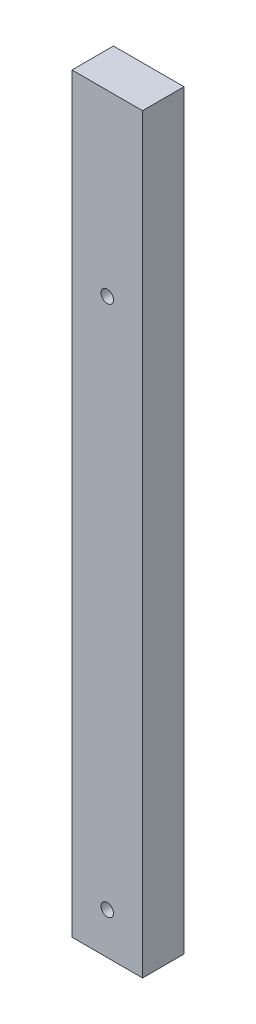
ISO-10303-21;
HEADER;
FILE_DESCRIPTION(('STEP AP214'),'2;1');
FILE_NAME('part.step','',(''),(''),'','','');
FILE_SCHEMA(('AUTOMOTIVE_DESIGN { 1 0 10303 214 1 1 1 1 }'));
ENDSEC;
DATA;
#1=APPLICATION_CONTEXT('core data for automotive mechanical design processes');
#2=APPLICATION_PROTOCOL_DEFINITION('international standard','automotive_design',2000,#1);
#3=PRODUCT_CONTEXT('',#1,'mechanical');
#4=PRODUCT('Part','Part','',(#3));
#5=PRODUCT_RELATED_PRODUCT_CATEGORY('part','',(#4));
#6=PRODUCT_DEFINITION_FORMATION('','',#4);
#7=PRODUCT_DEFINITION_CONTEXT('part definition',#1,'design');
#8=PRODUCT_DEFINITION('design','',#6,#7);
#9=PRODUCT_DEFINITION_SHAPE('','',#8);
#10=(LENGTH_UNIT() NAMED_UNIT(*) SI_UNIT(.MILLI.,.METRE.));
#11=(NAMED_UNIT(*) PLANE_ANGLE_UNIT() SI_UNIT($,.RADIAN.));
#12=(NAMED_UNIT(*) SI_UNIT($,.STERADIAN.) SOLID_ANGLE_UNIT());
#13=UNCERTAINTY_MEASURE_WITH_UNIT(LENGTH_MEASURE(1.E-05),#10,'distance_accuracy_value','');
#14=(GEOMETRIC_REPRESENTATION_CONTEXT(3) GLOBAL_UNCERTAINTY_ASSIGNED_CONTEXT((#13)) GLOBAL_UNIT_ASSIGNED_CONTEXT((#10,
#11,#12)) REPRESENTATION_CONTEXT('',''));
#15=CARTESIAN_POINT('',(0.,0.,0.));
#16=DIRECTION('',(0.,0.,1.));
#17=DIRECTION('',(1.,0.,0.));
#18=AXIS2_PLACEMENT_3D('',#15,#16,#17);
#19=CARTESIAN_POINT('',(-8.50000000000001,90.5,10.));
#20=DIRECTION('',(1.,0.,0.));
#21=DIRECTION('',(0.,1.,0.));
#22=AXIS2_PLACEMENT_3D('',#19,#20,#21);
#23=PLANE('',#22);
#24=DIRECTION('',(0.,-1.,0.));
#25=VECTOR('',#24,1.);
#26=CARTESIAN_POINT('',(-8.50000000000001,90.5,0.));
#27=LINE('',#26,#25);
#28=CARTESIAN_POINT('',(-8.50000000000001,90.5,0.));
#29=VERTEX_POINT('',#28);
#30=CARTESIAN_POINT('',(-8.49999999999999,-90.5,0.));
#31=VERTEX_POINT('',#30);
#32=EDGE_CURVE('E96',#29,#31,#27,.T.);
#33=ORIENTED_EDGE('',*,*,#32,.T.);
#34=DIRECTION('',(0.,0.,-1.));
#35=VECTOR('',#34,1.);
#36=CARTESIAN_POINT('',(-8.49999999999999,-90.5,10.));
#37=LINE('',#36,#35);
#38=CARTESIAN_POINT('',(-8.49999999999999,-90.5,10.));
#39=VERTEX_POINT('',#38);
#40=EDGE_CURVE('E11',#39,#31,#37,.T.);
#41=ORIENTED_EDGE('',*,*,#40,.F.);
#42=DIRECTION('',(0.,-1.,0.));
#43=VECTOR('',#42,1.);
#44=CARTESIAN_POINT('',(-8.50000000000001,90.5,10.));
#45=LINE('',#44,#43);
#46=CARTESIAN_POINT('',(-8.50000000000001,90.5,10.));
#47=VERTEX_POINT('',#46);
#48=EDGE_CURVE('E84',#47,#39,#45,.T.);
#49=ORIENTED_EDGE('',*,*,#48,.F.);
#50=DIRECTION('',(0.,0.,-1.));
#51=VECTOR('',#50,1.);
#52=CARTESIAN_POINT('',(-8.50000000000001,90.5,10.));
#53=LINE('',#52,#51);
#54=EDGE_CURVE('E92',#47,#29,#53,.T.);
#55=ORIENTED_EDGE('',*,*,#54,.T.);
#56=EDGE_LOOP('',(#33,#41,#49,#55));
#57=FACE_BOUND('',#56,.T.);
#58=ADVANCED_FACE('F33',(#57),#23,.F.);
#59=CARTESIAN_POINT('',(-8.49999999999999,-90.5,10.));
#60=DIRECTION('',(0.,1.,0.));
#61=DIRECTION('',(0.,0.,1.));
#62=AXIS2_PLACEMENT_3D('',#59,#60,#61);
#63=PLANE('',#62);
#64=DIRECTION('',(1.,0.,0.));
#65=VECTOR('',#64,1.);
#66=CARTESIAN_POINT('',(-8.49999999999999,-90.5,0.));
#67=LINE('',#66,#65);
#68=CARTESIAN_POINT('',(8.50000000000001,-90.5,0.));
#69=VERTEX_POINT('',#68);
#70=EDGE_CURVE('E88',#31,#69,#67,.T.);
#71=ORIENTED_EDGE('',*,*,#70,.T.);
#72=DIRECTION('',(0.,0.,-1.));
#73=VECTOR('',#72,1.);
#74=CARTESIAN_POINT('',(8.50000000000001,-90.5,10.));
#75=LINE('',#74,#73);
#76=CARTESIAN_POINT('',(8.50000000000001,-90.5,10.));
#77=VERTEX_POINT('',#76);
#78=EDGE_CURVE('E41',#77,#69,#75,.T.);
#79=ORIENTED_EDGE('',*,*,#78,.F.);
#80=DIRECTION('',(1.,0.,0.));
#81=VECTOR('',#80,1.);
#82=CARTESIAN_POINT('',(-8.49999999999999,-90.5,10.));
#83=LINE('',#82,#81);
#84=EDGE_CURVE('E79',#39,#77,#83,.T.);
#85=ORIENTED_EDGE('',*,*,#84,.F.);
#86=ORIENTED_EDGE('',*,*,#40,.T.);
#87=EDGE_LOOP('',(#71,#79,#85,#86));
#88=FACE_BOUND('',#87,.T.);
#89=ADVANCED_FACE('F87',(#88),#63,.F.);
#90=CARTESIAN_POINT('',(8.49999999999999,90.5,10.));
#91=DIRECTION('',(-1.,0.,0.));
#92=DIRECTION('',(0.,-1.,0.));
#93=AXIS2_PLACEMENT_3D('',#90,#91,#92);
#94=PLANE('',#93);
#95=DIRECTION('',(0.,1.,0.));
#96=VECTOR('',#95,1.);
#97=CARTESIAN_POINT('',(8.49999999999999,90.5,0.));
#98=LINE('',#97,#96);
#99=CARTESIAN_POINT('',(8.49999999999999,90.5,0.));
#100=VERTEX_POINT('',#99);
#101=EDGE_CURVE('E66',#69,#100,#98,.T.);
#102=ORIENTED_EDGE('',*,*,#101,.T.);
#103=DIRECTION('',(0.,0.,-1.));
#104=VECTOR('',#103,1.);
#105=CARTESIAN_POINT('',(8.49999999999999,90.5,10.));
#106=LINE('',#105,#104);
#107=CARTESIAN_POINT('',(8.49999999999999,90.5,10.));
#108=VERTEX_POINT('',#107);
#109=EDGE_CURVE('E89',#108,#100,#106,.T.);
#110=ORIENTED_EDGE('',*,*,#109,.F.);
#111=DIRECTION('',(0.,1.,0.));
#112=VECTOR('',#111,1.);
#113=CARTESIAN_POINT('',(8.49999999999999,90.5,10.));
#114=LINE('',#113,#112);
#115=EDGE_CURVE('E82',#77,#108,#114,.T.);
#116=ORIENTED_EDGE('',*,*,#115,.F.);
#117=ORIENTED_EDGE('',*,*,#78,.T.);
#118=EDGE_LOOP('',(#102,#110,#116,#117));
#119=FACE_BOUND('',#118,.T.);
#120=ADVANCED_FACE('F90',(#119),#94,.F.);
#121=CARTESIAN_POINT('',(-8.50000000000001,90.5,10.));
#122=DIRECTION('',(0.,-1.,0.));
#123=DIRECTION('',(0.,0.,-1.));
#124=AXIS2_PLACEMENT_3D('',#121,#122,#123);
#125=PLANE('',#124);
#126=DIRECTION('',(-1.,0.,0.));
#127=VECTOR('',#126,1.);
#128=CARTESIAN_POINT('',(-8.50000000000001,90.5,0.));
#129=LINE('',#128,#127);
#130=EDGE_CURVE('E72',#100,#29,#129,.T.);
#131=ORIENTED_EDGE('',*,*,#130,.T.);
#132=ORIENTED_EDGE('',*,*,#54,.F.);
#133=DIRECTION('',(-1.,0.,0.));
#134=VECTOR('',#133,1.);
#135=CARTESIAN_POINT('',(-8.50000000000001,90.5,10.));
#136=LINE('',#135,#134);
#137=EDGE_CURVE('E49',#108,#47,#136,.T.);
#138=ORIENTED_EDGE('',*,*,#137,.F.);
#139=ORIENTED_EDGE('',*,*,#109,.T.);
#140=EDGE_LOOP('',(#131,#132,#138,#139));
#141=FACE_BOUND('',#140,.T.);
#142=ADVANCED_FACE('F104',(#141),#125,.F.);
#143=CARTESIAN_POINT('',(0.,0.,10.));
#144=DIRECTION('',(0.,0.,1.));
#145=DIRECTION('',(1.,0.,0.));
#146=AXIS2_PLACEMENT_3D('',#143,#144,#145);
#147=PLANE('',#146);
#148=CARTESIAN_POINT('',(0.,-80.5,10.));
#149=DIRECTION('',(0.,0.,1.));
#150=DIRECTION('',(1.,0.,0.));
#151=AXIS2_PLACEMENT_3D('',#148,#149,#150);
#152=CIRCLE('',#151,1.5);
#153=CARTESIAN_POINT('',(1.5,-80.5,10.));
#154=VERTEX_POINT('',#153);
#155=EDGE_CURVE('E116',#154,#154,#152,.T.);
#156=ORIENTED_EDGE('',*,*,#155,.F.);
#157=EDGE_LOOP('',(#156));
#158=FACE_BOUND('',#157,.T.);
#159=CARTESIAN_POINT('',(0.,47.5,10.));
#160=DIRECTION('',(0.,0.,1.));
#161=DIRECTION('',(1.,0.,0.));
#162=AXIS2_PLACEMENT_3D('',#159,#160,#161);
#163=CIRCLE('',#162,1.5);
#164=CARTESIAN_POINT('',(1.5,47.5,10.));
#165=VERTEX_POINT('',#164);
#166=EDGE_CURVE('E110',#165,#165,#163,.T.);
#167=ORIENTED_EDGE('',*,*,#166,.F.);
#168=EDGE_LOOP('',(#167));
#169=FACE_BOUND('',#168,.T.);
#170=ORIENTED_EDGE('',*,*,#48,.T.);
#171=ORIENTED_EDGE('',*,*,#84,.T.);
#172=ORIENTED_EDGE('',*,*,#115,.T.);
#173=ORIENTED_EDGE('',*,*,#137,.T.);
#174=EDGE_LOOP('',(#170,#171,#172,#173));
#175=FACE_BOUND('',#174,.T.);
#176=ADVANCED_FACE('F80',(#158,#169,#175),#147,.T.);
#177=CARTESIAN_POINT('',(0.,0.,0.));
#178=DIRECTION('',(0.,0.,1.));
#179=DIRECTION('',(1.,0.,0.));
#180=AXIS2_PLACEMENT_3D('',#177,#178,#179);
#181=PLANE('',#180);
#182=CARTESIAN_POINT('',(0.,-40.5,0.));
#183=DIRECTION('',(0.,0.,-1.));
#184=DIRECTION('',(-1.,0.,0.));
#185=AXIS2_PLACEMENT_3D('',#182,#183,#184);
#186=CIRCLE('',#185,1.5);
#187=CARTESIAN_POINT('',(-1.5,-40.5,0.));
#188=VERTEX_POINT('',#187);
#189=EDGE_CURVE('E128',#188,#188,#186,.T.);
#190=ORIENTED_EDGE('',*,*,#189,.F.);
#191=EDGE_LOOP('',(#190));
#192=FACE_BOUND('',#191,.T.);
#193=CARTESIAN_POINT('',(0.,14.5,0.));
#194=DIRECTION('',(0.,0.,-1.));
#195=DIRECTION('',(-1.,0.,0.));
#196=AXIS2_PLACEMENT_3D('',#193,#194,#195);
#197=CIRCLE('',#196,1.5);
#198=CARTESIAN_POINT('',(-1.5,14.5,0.));
#199=VERTEX_POINT('',#198);
#200=EDGE_CURVE('E122',#199,#199,#197,.T.);
#201=ORIENTED_EDGE('',*,*,#200,.F.);
#202=EDGE_LOOP('',(#201));
#203=FACE_BOUND('',#202,.T.);
#204=ORIENTED_EDGE('',*,*,#32,.F.);
#205=ORIENTED_EDGE('',*,*,#130,.F.);
#206=ORIENTED_EDGE('',*,*,#101,.F.);
#207=ORIENTED_EDGE('',*,*,#70,.F.);
#208=EDGE_LOOP('',(#204,#205,#206,#207));
#209=FACE_BOUND('',#208,.T.);
#210=ADVANCED_FACE('F107',(#192,#203,#209),#181,.F.);
#211=CARTESIAN_POINT('',(0.,47.5,5.));
#212=DIRECTION('',(0.,0.,1.));
#213=DIRECTION('',(1.,0.,0.));
#214=AXIS2_PLACEMENT_3D('',#211,#212,#213);
#215=CYLINDRICAL_SURFACE('',#214,1.5);
#216=CARTESIAN_POINT('',(0.,47.5,5.));
#217=DIRECTION('',(0.,0.,1.));
#218=DIRECTION('',(1.,0.,0.));
#219=AXIS2_PLACEMENT_3D('',#216,#217,#218);
#220=CIRCLE('',#219,1.5);
#221=CARTESIAN_POINT('',(1.5,47.5,5.));
#222=VERTEX_POINT('',#221);
#223=EDGE_CURVE('E99',#222,#222,#220,.T.);
#224=ORIENTED_EDGE('',*,*,#223,.F.);
#225=EDGE_LOOP('',(#224));
#226=FACE_BOUND('',#225,.T.);
#227=ORIENTED_EDGE('',*,*,#166,.T.);
#228=EDGE_LOOP('',(#227));
#229=FACE_BOUND('',#228,.T.);
#230=ADVANCED_FACE('F145',(#226,#229),#215,.F.);
#231=CARTESIAN_POINT('',(0.,47.5,5.));
#232=DIRECTION('',(0.,0.,1.));
#233=DIRECTION('',(1.,0.,0.));
#234=AXIS2_PLACEMENT_3D('',#231,#232,#233);
#235=PLANE('',#234);
#236=ORIENTED_EDGE('',*,*,#223,.T.);
#237=EDGE_LOOP('',(#236));
#238=FACE_BOUND('',#237,.T.);
#239=ADVANCED_FACE('F180',(#238),#235,.T.);
#240=CARTESIAN_POINT('',(0.,-80.5,5.));
#241=DIRECTION('',(0.,0.,1.));
#242=DIRECTION('',(1.,0.,0.));
#243=AXIS2_PLACEMENT_3D('',#240,#241,#242);
#244=CYLINDRICAL_SURFACE('',#243,1.5);
#245=CARTESIAN_POINT('',(0.,-80.5,5.));
#246=DIRECTION('',(0.,0.,1.));
#247=DIRECTION('',(1.,0.,0.));
#248=AXIS2_PLACEMENT_3D('',#245,#246,#247);
#249=CIRCLE('',#248,1.5);
#250=CARTESIAN_POINT('',(1.5,-80.5,5.));
#251=VERTEX_POINT('',#250);
#252=EDGE_CURVE('E113',#251,#251,#249,.T.);
#253=ORIENTED_EDGE('',*,*,#252,.F.);
#254=EDGE_LOOP('',(#253));
#255=FACE_BOUND('',#254,.T.);
#256=ORIENTED_EDGE('',*,*,#155,.T.);
#257=EDGE_LOOP('',(#256));
#258=FACE_BOUND('',#257,.T.);
#259=ADVANCED_FACE('F160',(#255,#258),#244,.F.);
#260=CARTESIAN_POINT('',(0.,-80.5,5.));
#261=DIRECTION('',(0.,0.,1.));
#262=DIRECTION('',(1.,0.,0.));
#263=AXIS2_PLACEMENT_3D('',#260,#261,#262);
#264=PLANE('',#263);
#265=ORIENTED_EDGE('',*,*,#252,.T.);
#266=EDGE_LOOP('',(#265));
#267=FACE_BOUND('',#266,.T.);
#268=ADVANCED_FACE('F151',(#267),#264,.T.);
#269=CARTESIAN_POINT('',(0.,14.5,5.));
#270=DIRECTION('',(0.,0.,-1.));
#271=DIRECTION('',(-1.,0.,0.));
#272=AXIS2_PLACEMENT_3D('',#269,#270,#271);
#273=CYLINDRICAL_SURFACE('',#272,1.5);
#274=CARTESIAN_POINT('',(0.,14.5,5.));
#275=DIRECTION('',(0.,0.,-1.));
#276=DIRECTION('',(-1.,0.,0.));
#277=AXIS2_PLACEMENT_3D('',#274,#275,#276);
#278=CIRCLE('',#277,1.5);
#279=CARTESIAN_POINT('',(-1.5,14.5,5.));
#280=VERTEX_POINT('',#279);
#281=EDGE_CURVE('E119',#280,#280,#278,.T.);
#282=ORIENTED_EDGE('',*,*,#281,.F.);
#283=EDGE_LOOP('',(#282));
#284=FACE_BOUND('',#283,.T.);
#285=ORIENTED_EDGE('',*,*,#200,.T.);
#286=EDGE_LOOP('',(#285));
#287=FACE_BOUND('',#286,.T.);
#288=ADVANCED_FACE('F149',(#284,#287),#273,.F.);
#289=CARTESIAN_POINT('',(0.,14.5,5.));
#290=DIRECTION('',(0.,0.,-1.));
#291=DIRECTION('',(-1.,0.,0.));
#292=AXIS2_PLACEMENT_3D('',#289,#290,#291);
#293=PLANE('',#292);
#294=ORIENTED_EDGE('',*,*,#281,.T.);
#295=EDGE_LOOP('',(#294));
#296=FACE_BOUND('',#295,.T.);
#297=ADVANCED_FACE('F139',(#296),#293,.T.);
#298=CARTESIAN_POINT('',(0.,-40.5,5.));
#299=DIRECTION('',(0.,0.,-1.));
#300=DIRECTION('',(-1.,0.,0.));
#301=AXIS2_PLACEMENT_3D('',#298,#299,#300);
#302=CYLINDRICAL_SURFACE('',#301,1.5);
#303=CARTESIAN_POINT('',(0.,-40.5,5.));
#304=DIRECTION('',(0.,0.,-1.));
#305=DIRECTION('',(-1.,0.,0.));
#306=AXIS2_PLACEMENT_3D('',#303,#304,#305);
#307=CIRCLE('',#306,1.5);
#308=CARTESIAN_POINT('',(-1.5,-40.5,5.));
#309=VERTEX_POINT('',#308);
#310=EDGE_CURVE('E125',#309,#309,#307,.T.);
#311=ORIENTED_EDGE('',*,*,#310,.F.);
#312=EDGE_LOOP('',(#311));
#313=FACE_BOUND('',#312,.T.);
#314=ORIENTED_EDGE('',*,*,#189,.T.);
#315=EDGE_LOOP('',(#314));
#316=FACE_BOUND('',#315,.T.);
#317=ADVANCED_FACE('F136',(#313,#316),#302,.F.);
#318=CARTESIAN_POINT('',(0.,-40.5,5.));
#319=DIRECTION('',(0.,0.,-1.));
#320=DIRECTION('',(-1.,0.,0.));
#321=AXIS2_PLACEMENT_3D('',#318,#319,#320);
#322=PLANE('',#321);
#323=ORIENTED_EDGE('',*,*,#310,.T.);
#324=EDGE_LOOP('',(#323));
#325=FACE_BOUND('',#324,.T.);
#326=ADVANCED_FACE('F134',(#325),#322,.T.);
#327=CLOSED_SHELL('',(#58,#89,#120,#142,#176,#210,#230,#239,#259,#268,#288,#297,#317,#326));
#328=MANIFOLD_SOLID_BREP('B2',#327);
#329=ADVANCED_BREP_SHAPE_REPRESENTATION('',(#18,#328),#14);
#330=SHAPE_DEFINITION_REPRESENTATION(#9,#329);
ENDSEC;
END-ISO-10303-21;
